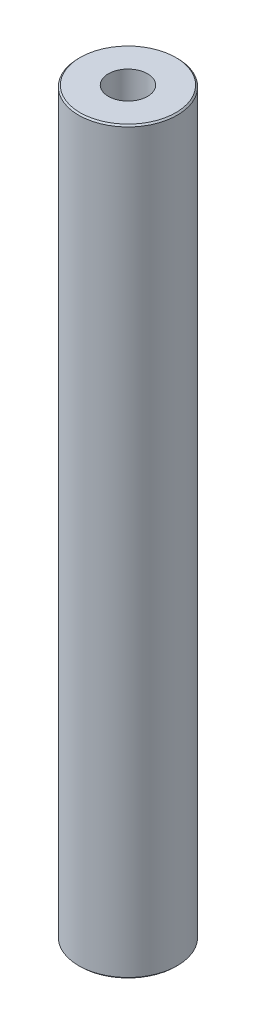
ISO-10303-21;
HEADER;
FILE_DESCRIPTION(('STEP AP214'),'2;1');
FILE_NAME('part.step','',(''),(''),'','','');
FILE_SCHEMA(('AUTOMOTIVE_DESIGN { 1 0 10303 214 1 1 1 1 }'));
ENDSEC;
DATA;
#1=APPLICATION_CONTEXT('core data for automotive mechanical design processes');
#2=APPLICATION_PROTOCOL_DEFINITION('international standard','automotive_design',2000,#1);
#3=PRODUCT_CONTEXT('',#1,'mechanical');
#4=PRODUCT('Part','Part','',(#3));
#5=PRODUCT_RELATED_PRODUCT_CATEGORY('part','',(#4));
#6=PRODUCT_DEFINITION_FORMATION('','',#4);
#7=PRODUCT_DEFINITION_CONTEXT('part definition',#1,'design');
#8=PRODUCT_DEFINITION('design','',#6,#7);
#9=PRODUCT_DEFINITION_SHAPE('','',#8);
#10=(LENGTH_UNIT() NAMED_UNIT(*) SI_UNIT(.MILLI.,.METRE.));
#11=(NAMED_UNIT(*) PLANE_ANGLE_UNIT() SI_UNIT($,.RADIAN.));
#12=(NAMED_UNIT(*) SI_UNIT($,.STERADIAN.) SOLID_ANGLE_UNIT());
#13=UNCERTAINTY_MEASURE_WITH_UNIT(LENGTH_MEASURE(1.E-05),#10,'distance_accuracy_value','');
#14=(GEOMETRIC_REPRESENTATION_CONTEXT(3) GLOBAL_UNCERTAINTY_ASSIGNED_CONTEXT((#13)) GLOBAL_UNIT_ASSIGNED_CONTEXT((#10,
#11,#12)) REPRESENTATION_CONTEXT('',''));
#15=CARTESIAN_POINT('',(0.,0.,0.));
#16=DIRECTION('',(0.,0.,1.));
#17=DIRECTION('',(1.,0.,0.));
#18=AXIS2_PLACEMENT_3D('',#15,#16,#17);
#19=CARTESIAN_POINT('',(0.,600.,0.));
#20=DIRECTION('',(0.,-1.,0.));
#21=DIRECTION('',(0.,0.,-1.));
#22=AXIS2_PLACEMENT_3D('',#19,#20,#21);
#23=CYLINDRICAL_SURFACE('',#22,40.);
#24=CARTESIAN_POINT('',(0.,598.821215453083,0.));
#25=DIRECTION('',(0.,1.,0.));
#26=DIRECTION('',(0.,0.,1.));
#27=AXIS2_PLACEMENT_3D('',#24,#25,#26);
#28=CIRCLE('',#27,40.);
#29=CARTESIAN_POINT('',(0.,598.821215453083,40.));
#30=VERTEX_POINT('',#29);
#31=EDGE_CURVE('E50',#30,#30,#28,.F.);
#32=ORIENTED_EDGE('',*,*,#31,.T.);
#33=EDGE_LOOP('',(#32));
#34=FACE_BOUND('',#33,.T.);
#35=CARTESIAN_POINT('',(0.,1.17878454691733,0.));
#36=DIRECTION('',(0.,1.,0.));
#37=DIRECTION('',(0.,0.,1.));
#38=AXIS2_PLACEMENT_3D('',#35,#36,#37);
#39=CIRCLE('',#38,40.);
#40=CARTESIAN_POINT('',(0.,1.17878454691733,40.));
#41=VERTEX_POINT('',#40);
#42=EDGE_CURVE('E51',#41,#41,#39,.T.);
#43=ORIENTED_EDGE('',*,*,#42,.T.);
#44=EDGE_LOOP('',(#43));
#45=FACE_BOUND('',#44,.T.);
#46=ADVANCED_FACE('F39',(#34,#45),#23,.T.);
#47=CARTESIAN_POINT('',(0.,600.,0.));
#48=DIRECTION('',(0.,1.,0.));
#49=DIRECTION('',(0.,0.,1.));
#50=AXIS2_PLACEMENT_3D('',#47,#48,#49);
#51=PLANE('',#50);
#52=CARTESIAN_POINT('',(0.,600.,0.));
#53=DIRECTION('',(0.,1.,0.));
#54=DIRECTION('',(0.,0.,1.));
#55=AXIS2_PLACEMENT_3D('',#52,#53,#54);
#56=CIRCLE('',#55,38.8212154530828);
#57=CARTESIAN_POINT('',(0.,600.,38.8212154530828));
#58=VERTEX_POINT('',#57);
#59=EDGE_CURVE('E54',#58,#58,#56,.T.);
#60=ORIENTED_EDGE('',*,*,#59,.T.);
#61=EDGE_LOOP('',(#60));
#62=FACE_BOUND('',#61,.T.);
#63=CARTESIAN_POINT('',(0.,600.,0.));
#64=DIRECTION('',(0.,1.,0.));
#65=DIRECTION('',(0.,0.,1.));
#66=AXIS2_PLACEMENT_3D('',#63,#64,#65);
#67=CIRCLE('',#66,15.9204694209148);
#68=CARTESIAN_POINT('',(0.,600.,15.9204694209148));
#69=VERTEX_POINT('',#68);
#70=EDGE_CURVE('E58',#69,#69,#67,.T.);
#71=ORIENTED_EDGE('',*,*,#70,.F.);
#72=EDGE_LOOP('',(#71));
#73=FACE_BOUND('',#72,.T.);
#74=ADVANCED_FACE('F69',(#62,#73),#51,.T.);
#75=CARTESIAN_POINT('',(0.,0.,0.));
#76=DIRECTION('',(0.,1.,0.));
#77=DIRECTION('',(0.,0.,1.));
#78=AXIS2_PLACEMENT_3D('',#75,#76,#77);
#79=PLANE('',#78);
#80=CARTESIAN_POINT('',(0.,0.,0.));
#81=DIRECTION('',(0.,1.,0.));
#82=DIRECTION('',(0.,0.,1.));
#83=AXIS2_PLACEMENT_3D('',#80,#81,#82);
#84=CIRCLE('',#83,38.8212154530828);
#85=CARTESIAN_POINT('',(0.,0.,38.8212154530828));
#86=VERTEX_POINT('',#85);
#87=EDGE_CURVE('E10',#86,#86,#84,.F.);
#88=ORIENTED_EDGE('',*,*,#87,.T.);
#89=EDGE_LOOP('',(#88));
#90=FACE_BOUND('',#89,.T.);
#91=CARTESIAN_POINT('',(0.,0.,0.));
#92=DIRECTION('',(0.,1.,0.));
#93=DIRECTION('',(0.,0.,1.));
#94=AXIS2_PLACEMENT_3D('',#91,#92,#93);
#95=CIRCLE('',#94,15.9204694209148);
#96=CARTESIAN_POINT('',(0.,0.,15.9204694209148));
#97=VERTEX_POINT('',#96);
#98=EDGE_CURVE('E63',#97,#97,#95,.T.);
#99=ORIENTED_EDGE('',*,*,#98,.T.);
#100=EDGE_LOOP('',(#99));
#101=FACE_BOUND('',#100,.T.);
#102=ADVANCED_FACE('F75',(#90,#101),#79,.F.);
#103=CARTESIAN_POINT('',(0.,600.,0.));
#104=DIRECTION('',(0.,-1.,0.));
#105=DIRECTION('',(0.,0.,-1.));
#106=AXIS2_PLACEMENT_3D('',#103,#104,#105);
#107=CYLINDRICAL_SURFACE('',#106,15.9204694209148);
#108=ORIENTED_EDGE('',*,*,#70,.T.);
#109=EDGE_LOOP('',(#108));
#110=FACE_BOUND('',#109,.T.);
#111=ORIENTED_EDGE('',*,*,#98,.F.);
#112=EDGE_LOOP('',(#111));
#113=FACE_BOUND('',#112,.T.);
#114=ADVANCED_FACE('F70',(#110,#113),#107,.F.);
#115=CARTESIAN_POINT('',(0.,600.,0.));
#116=DIRECTION('',(0.,-1.,0.));
#117=DIRECTION('',(0.,0.,-1.));
#118=AXIS2_PLACEMENT_3D('',#115,#116,#117);
#119=CONICAL_SURFACE('',#118,38.8212154530828,0.785398163397434);
#120=ORIENTED_EDGE('',*,*,#31,.F.);
#121=EDGE_LOOP('',(#120));
#122=FACE_BOUND('',#121,.T.);
#123=ORIENTED_EDGE('',*,*,#59,.F.);
#124=EDGE_LOOP('',(#123));
#125=FACE_BOUND('',#124,.T.);
#126=ADVANCED_FACE('F81',(#122,#125),#119,.T.);
#127=CARTESIAN_POINT('',(0.,1.17878454691733,0.));
#128=DIRECTION('',(0.,1.,0.));
#129=DIRECTION('',(0.,0.,1.));
#130=AXIS2_PLACEMENT_3D('',#127,#128,#129);
#131=CONICAL_SURFACE('',#130,40.,0.78539816339741);
#132=ORIENTED_EDGE('',*,*,#87,.F.);
#133=EDGE_LOOP('',(#132));
#134=FACE_BOUND('',#133,.T.);
#135=ORIENTED_EDGE('',*,*,#42,.F.);
#136=EDGE_LOOP('',(#135));
#137=FACE_BOUND('',#136,.T.);
#138=ADVANCED_FACE('F45',(#134,#137),#131,.T.);
#139=CLOSED_SHELL('',(#46,#74,#102,#114,#126,#138));
#140=MANIFOLD_SOLID_BREP('B2',#139);
#141=ADVANCED_BREP_SHAPE_REPRESENTATION('',(#18,#140),#14);
#142=SHAPE_DEFINITION_REPRESENTATION(#9,#141);
ENDSEC;
END-ISO-10303-21;
